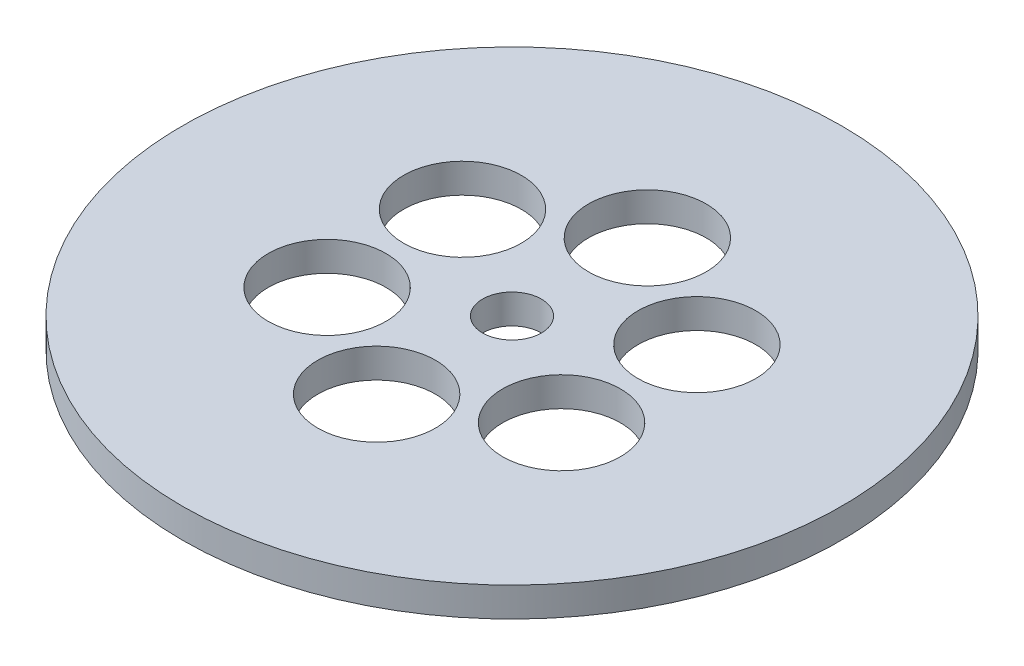
ISO-10303-21;
HEADER;
FILE_DESCRIPTION(('STEP AP214'),'2;1');
FILE_NAME('part.step','',(''),(''),'','','');
FILE_SCHEMA(('AUTOMOTIVE_DESIGN { 1 0 10303 214 1 1 1 1 }'));
ENDSEC;
DATA;
#1=APPLICATION_CONTEXT('core data for automotive mechanical design processes');
#2=APPLICATION_PROTOCOL_DEFINITION('international standard','automotive_design',2000,#1);
#3=PRODUCT_CONTEXT('',#1,'mechanical');
#4=PRODUCT('Part','Part','',(#3));
#5=PRODUCT_RELATED_PRODUCT_CATEGORY('part','',(#4));
#6=PRODUCT_DEFINITION_FORMATION('','',#4);
#7=PRODUCT_DEFINITION_CONTEXT('part definition',#1,'design');
#8=PRODUCT_DEFINITION('design','',#6,#7);
#9=PRODUCT_DEFINITION_SHAPE('','',#8);
#10=(LENGTH_UNIT() NAMED_UNIT(*) SI_UNIT(.MILLI.,.METRE.));
#11=(NAMED_UNIT(*) PLANE_ANGLE_UNIT() SI_UNIT($,.RADIAN.));
#12=(NAMED_UNIT(*) SI_UNIT($,.STERADIAN.) SOLID_ANGLE_UNIT());
#13=UNCERTAINTY_MEASURE_WITH_UNIT(LENGTH_MEASURE(1.E-05),#10,'distance_accuracy_value','');
#14=(GEOMETRIC_REPRESENTATION_CONTEXT(3) GLOBAL_UNCERTAINTY_ASSIGNED_CONTEXT((#13)) GLOBAL_UNIT_ASSIGNED_CONTEXT((#10,
#11,#12)) REPRESENTATION_CONTEXT('',''));
#15=CARTESIAN_POINT('',(0.,0.,0.));
#16=DIRECTION('',(0.,0.,1.));
#17=DIRECTION('',(1.,0.,0.));
#18=AXIS2_PLACEMENT_3D('',#15,#16,#17);
#19=CARTESIAN_POINT('',(0.,3.175,0.));
#20=DIRECTION('',(0.,-1.,0.));
#21=DIRECTION('',(0.,0.,-1.));
#22=AXIS2_PLACEMENT_3D('',#19,#20,#21);
#23=CYLINDRICAL_SURFACE('',#22,6.35);
#24=CARTESIAN_POINT('',(0.,3.175,0.));
#25=DIRECTION('',(0.,1.,0.));
#26=DIRECTION('',(0.,0.,1.));
#27=AXIS2_PLACEMENT_3D('',#24,#25,#26);
#28=CIRCLE('',#27,6.35);
#29=CARTESIAN_POINT('',(0.,3.175,6.35));
#30=VERTEX_POINT('',#29);
#31=EDGE_CURVE('E51',#30,#30,#28,.T.);
#32=ORIENTED_EDGE('',*,*,#31,.T.);
#33=EDGE_LOOP('',(#32));
#34=FACE_BOUND('',#33,.T.);
#35=CARTESIAN_POINT('',(0.,-3.175,0.));
#36=DIRECTION('',(0.,1.,0.));
#37=DIRECTION('',(0.,0.,1.));
#38=AXIS2_PLACEMENT_3D('',#35,#36,#37);
#39=CIRCLE('',#38,6.35);
#40=CARTESIAN_POINT('',(0.,-3.175,6.35));
#41=VERTEX_POINT('',#40);
#42=EDGE_CURVE('E77',#41,#41,#39,.T.);
#43=ORIENTED_EDGE('',*,*,#42,.F.);
#44=EDGE_LOOP('',(#43));
#45=FACE_BOUND('',#44,.T.);
#46=ADVANCED_FACE('F43',(#34,#45),#23,.F.);
#47=CARTESIAN_POINT('',(1.67885446879977E-12,3.175,-29.210000000002));
#48=DIRECTION('',(0.,-1.,0.));
#49=DIRECTION('',(0.,0.,-1.));
#50=AXIS2_PLACEMENT_3D('',#47,#48,#49);
#51=CYLINDRICAL_SURFACE('',#50,12.7041340015708);
#52=CARTESIAN_POINT('',(1.67885446879977E-12,3.175,-29.210000000002));
#53=DIRECTION('',(0.,1.,0.));
#54=DIRECTION('',(0.,0.,1.));
#55=AXIS2_PLACEMENT_3D('',#52,#53,#54);
#56=CIRCLE('',#55,12.7041340015708);
#57=CARTESIAN_POINT('',(1.67885446879977E-12,3.175,-16.5058659984312));
#58=VERTEX_POINT('',#57);
#59=EDGE_CURVE('E56',#58,#58,#56,.T.);
#60=ORIENTED_EDGE('',*,*,#59,.T.);
#61=EDGE_LOOP('',(#60));
#62=FACE_BOUND('',#61,.T.);
#63=CARTESIAN_POINT('',(1.67885446879977E-12,-3.175,-29.210000000002));
#64=DIRECTION('',(0.,1.,0.));
#65=DIRECTION('',(0.,0.,1.));
#66=AXIS2_PLACEMENT_3D('',#63,#64,#65);
#67=CIRCLE('',#66,12.7041340015708);
#68=CARTESIAN_POINT('',(1.67885446879977E-12,-3.175,-16.5058659984312));
#69=VERTEX_POINT('',#68);
#70=EDGE_CURVE('E75',#69,#69,#67,.T.);
#71=ORIENTED_EDGE('',*,*,#70,.F.);
#72=EDGE_LOOP('',(#71));
#73=FACE_BOUND('',#72,.T.);
#74=ADVANCED_FACE('F104',(#62,#73),#51,.F.);
#75=CARTESIAN_POINT('',(25.2966020445472,3.175,-14.6050000000016));
#76=DIRECTION('',(0.,-1.,0.));
#77=DIRECTION('',(0.,0.,-1.));
#78=AXIS2_PLACEMENT_3D('',#75,#76,#77);
#79=CYLINDRICAL_SURFACE('',#78,12.7041340015708);
#80=CARTESIAN_POINT('',(25.2966020445472,3.175,-14.6050000000016));
#81=DIRECTION('',(0.,1.,0.));
#82=DIRECTION('',(0.,0.,1.));
#83=AXIS2_PLACEMENT_3D('',#80,#81,#82);
#84=CIRCLE('',#83,12.7041340015708);
#85=CARTESIAN_POINT('',(25.2966020445472,3.175,-1.90086599843083));
#86=VERTEX_POINT('',#85);
#87=EDGE_CURVE('E99',#86,#86,#84,.T.);
#88=ORIENTED_EDGE('',*,*,#87,.T.);
#89=EDGE_LOOP('',(#88));
#90=FACE_BOUND('',#89,.T.);
#91=CARTESIAN_POINT('',(25.2966020445472,-3.175,-14.6050000000016));
#92=DIRECTION('',(0.,1.,0.));
#93=DIRECTION('',(0.,0.,1.));
#94=AXIS2_PLACEMENT_3D('',#91,#92,#93);
#95=CIRCLE('',#94,12.7041340015708);
#96=CARTESIAN_POINT('',(25.2966020445472,-3.175,-1.90086599843083));
#97=VERTEX_POINT('',#96);
#98=EDGE_CURVE('E72',#97,#97,#95,.T.);
#99=ORIENTED_EDGE('',*,*,#98,.F.);
#100=EDGE_LOOP('',(#99));
#101=FACE_BOUND('',#100,.T.);
#102=ADVANCED_FACE('F122',(#90,#101),#79,.F.);
#103=CARTESIAN_POINT('',(25.2966020445479,3.175,14.6050000000004));
#104=DIRECTION('',(0.,-1.,0.));
#105=DIRECTION('',(0.,0.,-1.));
#106=AXIS2_PLACEMENT_3D('',#103,#104,#105);
#107=CYLINDRICAL_SURFACE('',#106,12.7041340015708);
#108=CARTESIAN_POINT('',(25.2966020445479,3.175,14.6050000000004));
#109=DIRECTION('',(0.,1.,0.));
#110=DIRECTION('',(0.,0.,1.));
#111=AXIS2_PLACEMENT_3D('',#108,#109,#110);
#112=CIRCLE('',#111,12.7041340015708);
#113=CARTESIAN_POINT('',(25.2966020445479,3.175,27.3091340015712));
#114=VERTEX_POINT('',#113);
#115=EDGE_CURVE('E96',#114,#114,#112,.T.);
#116=ORIENTED_EDGE('',*,*,#115,.T.);
#117=EDGE_LOOP('',(#116));
#118=FACE_BOUND('',#117,.T.);
#119=CARTESIAN_POINT('',(25.2966020445479,-3.175,14.6050000000004));
#120=DIRECTION('',(0.,1.,0.));
#121=DIRECTION('',(0.,0.,1.));
#122=AXIS2_PLACEMENT_3D('',#119,#120,#121);
#123=CIRCLE('',#122,12.7041340015708);
#124=CARTESIAN_POINT('',(25.2966020445479,-3.175,27.3091340015712));
#125=VERTEX_POINT('',#124);
#126=EDGE_CURVE('E69',#125,#125,#123,.T.);
#127=ORIENTED_EDGE('',*,*,#126,.F.);
#128=EDGE_LOOP('',(#127));
#129=FACE_BOUND('',#128,.T.);
#130=ADVANCED_FACE('F129',(#118,#129),#107,.F.);
#131=CARTESIAN_POINT('',(3.06880811447256E-12,3.175,29.210000000002));
#132=DIRECTION('',(0.,-1.,0.));
#133=DIRECTION('',(0.,0.,-1.));
#134=AXIS2_PLACEMENT_3D('',#131,#132,#133);
#135=CYLINDRICAL_SURFACE('',#134,12.7041340015708);
#136=CARTESIAN_POINT('',(3.06880811447256E-12,3.175,29.210000000002));
#137=DIRECTION('',(0.,1.,0.));
#138=DIRECTION('',(0.,0.,1.));
#139=AXIS2_PLACEMENT_3D('',#136,#137,#138);
#140=CIRCLE('',#139,12.7041340015708);
#141=CARTESIAN_POINT('',(3.06880811447256E-12,3.175,41.9141340015728));
#142=VERTEX_POINT('',#141);
#143=EDGE_CURVE('E91',#142,#142,#140,.T.);
#144=ORIENTED_EDGE('',*,*,#143,.T.);
#145=EDGE_LOOP('',(#144));
#146=FACE_BOUND('',#145,.T.);
#147=CARTESIAN_POINT('',(3.06880811447256E-12,-3.175,29.210000000002));
#148=DIRECTION('',(0.,1.,0.));
#149=DIRECTION('',(0.,0.,1.));
#150=AXIS2_PLACEMENT_3D('',#147,#148,#149);
#151=CIRCLE('',#150,12.7041340015708);
#152=CARTESIAN_POINT('',(3.06880811447256E-12,-3.175,41.9141340015728));
#153=VERTEX_POINT('',#152);
#154=EDGE_CURVE('E66',#153,#153,#151,.T.);
#155=ORIENTED_EDGE('',*,*,#154,.F.);
#156=EDGE_LOOP('',(#155));
#157=FACE_BOUND('',#156,.T.);
#158=ADVANCED_FACE('F133',(#146,#157),#135,.F.);
#159=CARTESIAN_POINT('',(-25.2966020445425,3.175,14.6050000000016));
#160=DIRECTION('',(0.,-1.,0.));
#161=DIRECTION('',(0.,0.,-1.));
#162=AXIS2_PLACEMENT_3D('',#159,#160,#161);
#163=CYLINDRICAL_SURFACE('',#162,12.7041340015708);
#164=CARTESIAN_POINT('',(-25.2966020445425,3.175,14.6050000000016));
#165=DIRECTION('',(0.,1.,0.));
#166=DIRECTION('',(0.,0.,1.));
#167=AXIS2_PLACEMENT_3D('',#164,#165,#166);
#168=CIRCLE('',#167,12.7041340015708);
#169=CARTESIAN_POINT('',(-25.2966020445425,3.175,27.3091340015724));
#170=VERTEX_POINT('',#169);
#171=EDGE_CURVE('E86',#170,#170,#168,.T.);
#172=ORIENTED_EDGE('',*,*,#171,.T.);
#173=EDGE_LOOP('',(#172));
#174=FACE_BOUND('',#173,.T.);
#175=CARTESIAN_POINT('',(-25.2966020445425,-3.175,14.6050000000016));
#176=DIRECTION('',(0.,1.,0.));
#177=DIRECTION('',(0.,0.,1.));
#178=AXIS2_PLACEMENT_3D('',#175,#176,#177);
#179=CIRCLE('',#178,12.7041340015708);
#180=CARTESIAN_POINT('',(-25.2966020445425,-3.175,27.3091340015724));
#181=VERTEX_POINT('',#180);
#182=EDGE_CURVE('E63',#181,#181,#179,.T.);
#183=ORIENTED_EDGE('',*,*,#182,.F.);
#184=EDGE_LOOP('',(#183));
#185=FACE_BOUND('',#184,.T.);
#186=ADVANCED_FACE('F136',(#174,#185),#163,.F.);
#187=CARTESIAN_POINT('',(-25.2966020445432,3.175,-14.6050000000004));
#188=DIRECTION('',(0.,-1.,0.));
#189=DIRECTION('',(0.,0.,-1.));
#190=AXIS2_PLACEMENT_3D('',#187,#188,#189);
#191=CYLINDRICAL_SURFACE('',#190,12.7041340015708);
#192=CARTESIAN_POINT('',(-25.2966020445432,3.175,-14.6050000000004));
#193=DIRECTION('',(0.,1.,0.));
#194=DIRECTION('',(0.,0.,1.));
#195=AXIS2_PLACEMENT_3D('',#192,#193,#194);
#196=CIRCLE('',#195,12.7041340015708);
#197=CARTESIAN_POINT('',(-25.2966020445432,3.175,-1.90086599842961));
#198=VERTEX_POINT('',#197);
#199=EDGE_CURVE('E82',#198,#198,#196,.T.);
#200=ORIENTED_EDGE('',*,*,#199,.T.);
#201=EDGE_LOOP('',(#200));
#202=FACE_BOUND('',#201,.T.);
#203=CARTESIAN_POINT('',(-25.2966020445432,-3.175,-14.6050000000004));
#204=DIRECTION('',(0.,1.,0.));
#205=DIRECTION('',(0.,0.,1.));
#206=AXIS2_PLACEMENT_3D('',#203,#204,#205);
#207=CIRCLE('',#206,12.7041340015708);
#208=CARTESIAN_POINT('',(-25.2966020445432,-3.175,-1.90086599842961));
#209=VERTEX_POINT('',#208);
#210=EDGE_CURVE('E60',#209,#209,#207,.T.);
#211=ORIENTED_EDGE('',*,*,#210,.F.);
#212=EDGE_LOOP('',(#211));
#213=FACE_BOUND('',#212,.T.);
#214=ADVANCED_FACE('F45',(#202,#213),#191,.F.);
#215=CARTESIAN_POINT('',(0.,3.175,0.));
#216=DIRECTION('',(0.,-1.,0.));
#217=DIRECTION('',(0.,0.,-1.));
#218=AXIS2_PLACEMENT_3D('',#215,#216,#217);
#219=CYLINDRICAL_SURFACE('',#218,71.12);
#220=CARTESIAN_POINT('',(0.,3.175,0.));
#221=DIRECTION('',(0.,1.,0.));
#222=DIRECTION('',(0.,0.,1.));
#223=AXIS2_PLACEMENT_3D('',#220,#221,#222);
#224=CIRCLE('',#223,71.12);
#225=CARTESIAN_POINT('',(0.,3.175,71.12));
#226=VERTEX_POINT('',#225);
#227=EDGE_CURVE('E10',#226,#226,#224,.T.);
#228=ORIENTED_EDGE('',*,*,#227,.F.);
#229=EDGE_LOOP('',(#228));
#230=FACE_BOUND('',#229,.T.);
#231=CARTESIAN_POINT('',(0.,-3.175,0.));
#232=DIRECTION('',(0.,1.,0.));
#233=DIRECTION('',(0.,0.,1.));
#234=AXIS2_PLACEMENT_3D('',#231,#232,#233);
#235=CIRCLE('',#234,71.12);
#236=CARTESIAN_POINT('',(0.,-3.175,71.12));
#237=VERTEX_POINT('',#236);
#238=EDGE_CURVE('E47',#237,#237,#235,.T.);
#239=ORIENTED_EDGE('',*,*,#238,.T.);
#240=EDGE_LOOP('',(#239));
#241=FACE_BOUND('',#240,.T.);
#242=ADVANCED_FACE('F111',(#230,#241),#219,.T.);
#243=CARTESIAN_POINT('',(0.,3.175,0.));
#244=DIRECTION('',(0.,1.,0.));
#245=DIRECTION('',(0.,0.,1.));
#246=AXIS2_PLACEMENT_3D('',#243,#244,#245);
#247=PLANE('',#246);
#248=ORIENTED_EDGE('',*,*,#199,.F.);
#249=EDGE_LOOP('',(#248));
#250=FACE_BOUND('',#249,.T.);
#251=ORIENTED_EDGE('',*,*,#171,.F.);
#252=EDGE_LOOP('',(#251));
#253=FACE_BOUND('',#252,.T.);
#254=ORIENTED_EDGE('',*,*,#143,.F.);
#255=EDGE_LOOP('',(#254));
#256=FACE_BOUND('',#255,.T.);
#257=ORIENTED_EDGE('',*,*,#115,.F.);
#258=EDGE_LOOP('',(#257));
#259=FACE_BOUND('',#258,.T.);
#260=ORIENTED_EDGE('',*,*,#87,.F.);
#261=EDGE_LOOP('',(#260));
#262=FACE_BOUND('',#261,.T.);
#263=ORIENTED_EDGE('',*,*,#59,.F.);
#264=EDGE_LOOP('',(#263));
#265=FACE_BOUND('',#264,.T.);
#266=ORIENTED_EDGE('',*,*,#31,.F.);
#267=EDGE_LOOP('',(#266));
#268=FACE_BOUND('',#267,.T.);
#269=ORIENTED_EDGE('',*,*,#227,.T.);
#270=EDGE_LOOP('',(#269));
#271=FACE_BOUND('',#270,.T.);
#272=ADVANCED_FACE('F107',(#250,#253,#256,#259,#262,#265,#268,#271),#247,.T.);
#273=CARTESIAN_POINT('',(0.,-3.175,0.));
#274=DIRECTION('',(0.,1.,0.));
#275=DIRECTION('',(0.,0.,1.));
#276=AXIS2_PLACEMENT_3D('',#273,#274,#275);
#277=PLANE('',#276);
#278=ORIENTED_EDGE('',*,*,#210,.T.);
#279=EDGE_LOOP('',(#278));
#280=FACE_BOUND('',#279,.T.);
#281=ORIENTED_EDGE('',*,*,#182,.T.);
#282=EDGE_LOOP('',(#281));
#283=FACE_BOUND('',#282,.T.);
#284=ORIENTED_EDGE('',*,*,#154,.T.);
#285=EDGE_LOOP('',(#284));
#286=FACE_BOUND('',#285,.T.);
#287=ORIENTED_EDGE('',*,*,#126,.T.);
#288=EDGE_LOOP('',(#287));
#289=FACE_BOUND('',#288,.T.);
#290=ORIENTED_EDGE('',*,*,#98,.T.);
#291=EDGE_LOOP('',(#290));
#292=FACE_BOUND('',#291,.T.);
#293=ORIENTED_EDGE('',*,*,#70,.T.);
#294=EDGE_LOOP('',(#293));
#295=FACE_BOUND('',#294,.T.);
#296=ORIENTED_EDGE('',*,*,#42,.T.);
#297=EDGE_LOOP('',(#296));
#298=FACE_BOUND('',#297,.T.);
#299=ORIENTED_EDGE('',*,*,#238,.F.);
#300=EDGE_LOOP('',(#299));
#301=FACE_BOUND('',#300,.T.);
#302=ADVANCED_FACE('F110',(#280,#283,#286,#289,#292,#295,#298,#301),#277,.F.);
#303=CLOSED_SHELL('',(#46,#74,#102,#130,#158,#186,#214,#242,#272,#302));
#304=MANIFOLD_SOLID_BREP('B2',#303);
#305=ADVANCED_BREP_SHAPE_REPRESENTATION('',(#18,#304),#14);
#306=SHAPE_DEFINITION_REPRESENTATION(#9,#305);
ENDSEC;
END-ISO-10303-21;
